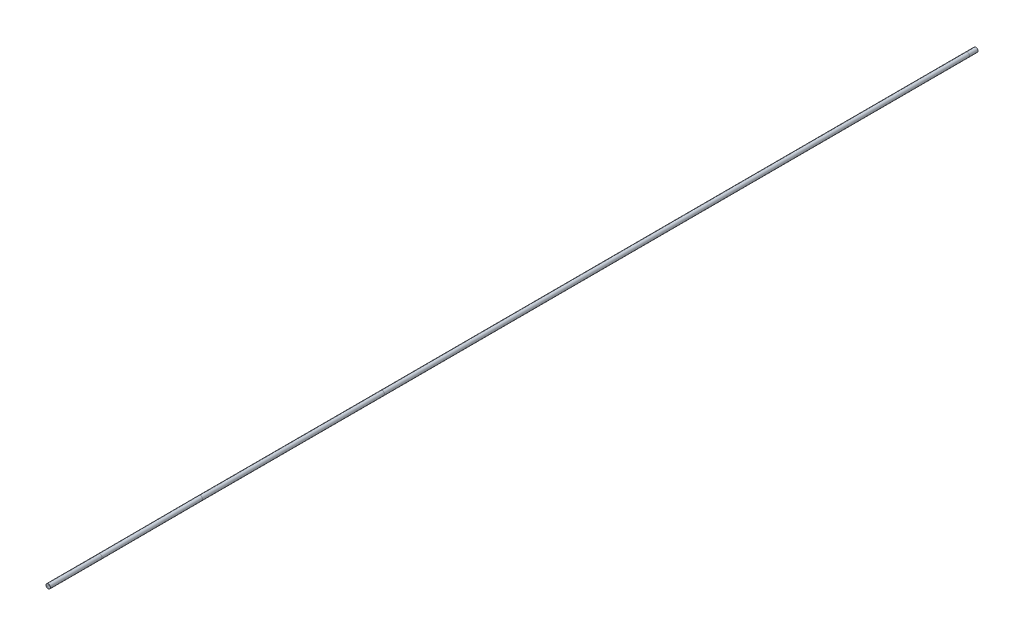
ISO-10303-21;
HEADER;
FILE_DESCRIPTION(('STEP AP214'),'2;1');
FILE_NAME('part.step','',(''),(''),'','','');
FILE_SCHEMA(('AUTOMOTIVE_DESIGN { 1 0 10303 214 1 1 1 1 }'));
ENDSEC;
DATA;
#1=APPLICATION_CONTEXT('core data for automotive mechanical design processes');
#2=APPLICATION_PROTOCOL_DEFINITION('international standard','automotive_design',2000,#1);
#3=PRODUCT_CONTEXT('',#1,'mechanical');
#4=PRODUCT('Part','Part','',(#3));
#5=PRODUCT_RELATED_PRODUCT_CATEGORY('part','',(#4));
#6=PRODUCT_DEFINITION_FORMATION('','',#4);
#7=PRODUCT_DEFINITION_CONTEXT('part definition',#1,'design');
#8=PRODUCT_DEFINITION('design','',#6,#7);
#9=PRODUCT_DEFINITION_SHAPE('','',#8);
#10=(LENGTH_UNIT() NAMED_UNIT(*) SI_UNIT(.MILLI.,.METRE.));
#11=(NAMED_UNIT(*) PLANE_ANGLE_UNIT() SI_UNIT($,.RADIAN.));
#12=(NAMED_UNIT(*) SI_UNIT($,.STERADIAN.) SOLID_ANGLE_UNIT());
#13=UNCERTAINTY_MEASURE_WITH_UNIT(LENGTH_MEASURE(1.E-05),#10,'distance_accuracy_value','');
#14=(GEOMETRIC_REPRESENTATION_CONTEXT(3) GLOBAL_UNCERTAINTY_ASSIGNED_CONTEXT((#13)) GLOBAL_UNIT_ASSIGNED_CONTEXT((#10,
#11,#12)) REPRESENTATION_CONTEXT('',''));
#15=CARTESIAN_POINT('',(0.,0.,0.));
#16=DIRECTION('',(0.,0.,1.));
#17=DIRECTION('',(1.,0.,0.));
#18=AXIS2_PLACEMENT_3D('',#15,#16,#17);
#19=CARTESIAN_POINT('',(-7.09899745318755,-7.80704253876515,-909.795823025885));
#20=DIRECTION('',(0.,0.,1.));
#21=DIRECTION('',(1.,0.,0.));
#22=AXIS2_PLACEMENT_3D('',#19,#20,#21);
#23=PLANE('',#22);
#24=CARTESIAN_POINT('',(-7.09899745318755,-7.80704253876515,-909.795823025885));
#25=DIRECTION('',(0.,0.,1.));
#26=DIRECTION('',(1.,0.,0.));
#27=AXIS2_PLACEMENT_3D('',#24,#25,#26);
#28=CIRCLE('',#27,2.1);
#29=CARTESIAN_POINT('',(-4.99899745318755,-7.80704253876515,-909.795823025885));
#30=VERTEX_POINT('',#29);
#31=EDGE_CURVE('E42',#30,#30,#28,.T.);
#32=ORIENTED_EDGE('',*,*,#31,.F.);
#33=EDGE_LOOP('',(#32));
#34=FACE_BOUND('',#33,.T.);
#35=ADVANCED_FACE('F39',(#34),#23,.F.);
#36=CARTESIAN_POINT('',(-17.2805682817183,-19.0041104478658,93.6165047554616));
#37=DIRECTION('',(0.,0.,1.));
#38=DIRECTION('',(1.,0.,0.));
#39=AXIS2_PLACEMENT_3D('',#36,#37,#38);
#40=PLANE('',#39);
#41=CARTESIAN_POINT('',(-17.2805682817183,-19.0041104478658,93.6165047554616));
#42=DIRECTION('',(0.,0.,1.));
#43=DIRECTION('',(1.,0.,0.));
#44=AXIS2_PLACEMENT_3D('',#41,#42,#43);
#45=CIRCLE('',#44,2.1);
#46=CARTESIAN_POINT('',(-15.1805682817183,-19.0041104478658,93.6165047554616));
#47=VERTEX_POINT('',#46);
#48=EDGE_CURVE('E46',#47,#47,#45,.T.);
#49=ORIENTED_EDGE('',*,*,#48,.T.);
#50=EDGE_LOOP('',(#49));
#51=FACE_BOUND('',#50,.T.);
#52=ADVANCED_FACE('F68',(#51),#40,.T.);
#53=CARTESIAN_POINT('',(-7.09899745318753,-7.80704253876517,-900.266459371352));
#54=DIRECTION('',(0.,0.,-1.));
#55=DIRECTION('',(-1.,0.,0.));
#56=AXIS2_PLACEMENT_3D('',#53,#54,#55);
#57=CYLINDRICAL_SURFACE('',#56,2.1);
#58=CARTESIAN_POINT('',(-7.09899745318754,-7.80704253876517,-900.466459371352));
#59=DIRECTION('',(0.00504607885021758,0.00554936841398394,-0.999971870403585));
#60=DIRECTION('',(0.67274134868714,0.739839725457515,0.00750056008286953));
#61=AXIS2_PLACEMENT_3D('',#58,#59,#60);
#62=ELLIPSE('',#61,2.1000590738142,2.1);
#63=CARTESIAN_POINT('',(-5.68620087954711,-6.25333541014991,-900.450707752092));
#64=VERTEX_POINT('',#63);
#65=EDGE_CURVE('E58',#64,#64,#62,.T.);
#66=ORIENTED_EDGE('',*,*,#65,.T.);
#67=EDGE_LOOP('',(#66));
#68=FACE_BOUND('',#67,.T.);
#69=ORIENTED_EDGE('',*,*,#31,.T.);
#70=EDGE_LOOP('',(#69));
#71=FACE_BOUND('',#70,.T.);
#72=ADVANCED_FACE('F65',(#68,#71),#57,.T.);
#73=CARTESIAN_POINT('',(-13.487074464187,-14.8322583237687,-267.545520811008));
#74=DIRECTION('',(0.0100918738121146,0.0110984246249779,-0.999887483196886));
#75=DIRECTION('',(0.,0.999938404315332,0.0110989898327681));
#76=AXIS2_PLACEMENT_3D('',#73,#74,#75);
#77=CYLINDRICAL_SURFACE('',#76,2.1);
#78=CARTESIAN_POINT('',(-13.4850560894246,-14.8300386388437,-267.745498307647));
#79=DIRECTION('',(0.00504607885021754,0.00554936841398395,-0.999971870403585));
#80=DIRECTION('',(-0.672741348687144,-0.739839725457512,-0.00750056008286951));
#81=AXIS2_PLACEMENT_3D('',#78,#79,#80);
#82=ELLIPSE('',#81,2.1000590738142,2.1);
#83=CARTESIAN_POINT('',(-14.897852663065,-16.383745767459,-267.761249926908));
#84=VERTEX_POINT('',#83);
#85=EDGE_CURVE('E56',#84,#84,#82,.T.);
#86=ORIENTED_EDGE('',*,*,#85,.T.);
#87=EDGE_LOOP('',(#86));
#88=FACE_BOUND('',#87,.T.);
#89=ORIENTED_EDGE('',*,*,#65,.F.);
#90=EDGE_LOOP('',(#89));
#91=FACE_BOUND('',#90,.T.);
#92=ADVANCED_FACE('F88',(#88,#91),#77,.T.);
#93=CARTESIAN_POINT('',(-13.4850560894241,-14.8300386388442,-68.7186343243757));
#94=DIRECTION('',(0.,0.,-1.));
#95=DIRECTION('',(-1.,0.,0.));
#96=AXIS2_PLACEMENT_3D('',#93,#94,#95);
#97=CYLINDRICAL_SURFACE('',#96,2.1);
#98=CARTESIAN_POINT('',(-13.485056089424,-14.8300386388442,-68.9510200389236));
#99=DIRECTION('',(0.0179059021207442,0.019691814298224,-0.999645742810365));
#100=DIRECTION('',(0.672521942998442,0.739598436521122,0.0266155759117366));
#101=AXIS2_PLACEMENT_3D('',#98,#99,#100);
#102=ELLIPSE('',#101,2.10074420373776,2.1);
#103=CARTESIAN_POINT('',(-12.0722595157836,-13.2763315102289,-68.8951075220978));
#104=VERTEX_POINT('',#103);
#105=EDGE_CURVE('E51',#104,#104,#102,.T.);
#106=ORIENTED_EDGE('',*,*,#105,.T.);
#107=EDGE_LOOP('',(#106));
#108=FACE_BOUND('',#107,.T.);
#109=ORIENTED_EDGE('',*,*,#85,.F.);
#110=EDGE_LOOP('',(#109));
#111=FACE_BOUND('',#110,.T.);
#112=ADVANCED_FACE('F81',(#108,#111),#97,.T.);
#113=CARTESIAN_POINT('',(-17.2888874852543,-19.0132593983085,37.1533328387921));
#114=DIRECTION('',(0.0357991176523646,0.0393696766628615,-0.998583222237773));
#115=DIRECTION('',(0.,0.999223718495005,0.0393949285697527));
#116=AXIS2_PLACEMENT_3D('',#113,#114,#115);
#117=CYLINDRICAL_SURFACE('',#116,2.1);
#118=CARTESIAN_POINT('',(-17.2805682817185,-19.0041104478657,36.9212763631568));
#119=DIRECTION('',(0.0179059021207442,0.019691814298224,-0.999645742810365));
#120=DIRECTION('',(-0.672521942998441,-0.739598436521122,-0.0266155759117366));
#121=AXIS2_PLACEMENT_3D('',#118,#119,#120);
#122=ELLIPSE('',#121,2.10074420373776,2.1);
#123=CARTESIAN_POINT('',(-18.6933648553589,-20.5578175764809,36.8653638463311));
#124=VERTEX_POINT('',#123);
#125=EDGE_CURVE('E11',#124,#124,#122,.T.);
#126=ORIENTED_EDGE('',*,*,#125,.T.);
#127=EDGE_LOOP('',(#126));
#128=FACE_BOUND('',#127,.T.);
#129=ORIENTED_EDGE('',*,*,#105,.F.);
#130=EDGE_LOOP('',(#129));
#131=FACE_BOUND('',#130,.T.);
#132=ADVANCED_FACE('F75',(#128,#131),#117,.T.);
#133=CARTESIAN_POINT('',(-17.2805682817183,-19.0041104478658,93.6165047554616));
#134=DIRECTION('',(0.,0.,-1.));
#135=DIRECTION('',(-1.,0.,0.));
#136=AXIS2_PLACEMENT_3D('',#133,#134,#135);
#137=CYLINDRICAL_SURFACE('',#136,2.1);
#138=ORIENTED_EDGE('',*,*,#48,.F.);
#139=EDGE_LOOP('',(#138));
#140=FACE_BOUND('',#139,.T.);
#141=ORIENTED_EDGE('',*,*,#125,.F.);
#142=EDGE_LOOP('',(#141));
#143=FACE_BOUND('',#142,.T.);
#144=ADVANCED_FACE('F73',(#140,#143),#137,.T.);
#145=CLOSED_SHELL('',(#35,#52,#72,#92,#112,#132,#144));
#146=MANIFOLD_SOLID_BREP('B2',#145);
#147=CARTESIAN_POINT('',(-7.09899745318755,-7.80704253876515,-909.795823025885));
#148=DIRECTION('',(0.,0.,1.));
#149=DIRECTION('',(1.,0.,0.));
#150=AXIS2_PLACEMENT_3D('',#147,#148,#149);
#151=PLANE('',#150);
#152=CARTESIAN_POINT('',(-7.09899745318755,-7.80704253876515,-909.795823025885));
#153=DIRECTION('',(0.,0.,1.));
#154=DIRECTION('',(1.,0.,0.));
#155=AXIS2_PLACEMENT_3D('',#152,#153,#154);
#156=CIRCLE('',#155,2.4);
#157=CARTESIAN_POINT('',(-4.69899745318756,-7.80704253876515,-909.795823025885));
#158=VERTEX_POINT('',#157);
#159=EDGE_CURVE('E143',#158,#158,#156,.T.);
#160=ORIENTED_EDGE('',*,*,#159,.F.);
#161=EDGE_LOOP('',(#160));
#162=FACE_BOUND('',#161,.T.);
#163=ADVANCED_FACE('F140',(#162),#151,.F.);
#164=CARTESIAN_POINT('',(-17.2805682817183,-19.0041104478658,93.6165047554616));
#165=DIRECTION('',(0.,0.,1.));
#166=DIRECTION('',(1.,0.,0.));
#167=AXIS2_PLACEMENT_3D('',#164,#165,#166);
#168=PLANE('',#167);
#169=CARTESIAN_POINT('',(-17.2805682817183,-19.0041104478658,93.6165047554616));
#170=DIRECTION('',(0.,0.,1.));
#171=DIRECTION('',(1.,0.,0.));
#172=AXIS2_PLACEMENT_3D('',#169,#170,#171);
#173=CIRCLE('',#172,2.4);
#174=CARTESIAN_POINT('',(-14.8805682817183,-19.0041104478658,93.6165047554616));
#175=VERTEX_POINT('',#174);
#176=EDGE_CURVE('E147',#175,#175,#173,.T.);
#177=ORIENTED_EDGE('',*,*,#176,.T.);
#178=EDGE_LOOP('',(#177));
#179=FACE_BOUND('',#178,.T.);
#180=ADVANCED_FACE('F169',(#179),#168,.T.);
#181=CARTESIAN_POINT('',(-7.09899745318753,-7.80704253876517,-900.266459371352));
#182=DIRECTION('',(0.,0.,-1.));
#183=DIRECTION('',(-1.,0.,0.));
#184=AXIS2_PLACEMENT_3D('',#181,#182,#183);
#185=CYLINDRICAL_SURFACE('',#184,2.4);
#186=CARTESIAN_POINT('',(-7.09899745318754,-7.80704253876517,-900.466459371352));
#187=DIRECTION('',(0.00504607885021758,0.00554936841398394,-0.999971870403585));
#188=DIRECTION('',(0.67274134868714,0.739839725457515,0.00750056008286953));
#189=AXIS2_PLACEMENT_3D('',#186,#187,#188);
#190=ELLIPSE('',#189,2.40006751293051,2.4);
#191=CARTESIAN_POINT('',(-5.48437279759848,-6.03137724891916,-900.448457520769));
#192=VERTEX_POINT('',#191);
#193=EDGE_CURVE('E159',#192,#192,#190,.T.);
#194=ORIENTED_EDGE('',*,*,#193,.T.);
#195=EDGE_LOOP('',(#194));
#196=FACE_BOUND('',#195,.T.);
#197=ORIENTED_EDGE('',*,*,#159,.T.);
#198=EDGE_LOOP('',(#197));
#199=FACE_BOUND('',#198,.T.);
#200=ADVANCED_FACE('F166',(#196,#199),#185,.T.);
#201=CARTESIAN_POINT('',(-13.487074464187,-14.8322583237687,-267.545520811008));
#202=DIRECTION('',(0.0100918738121146,0.0110984246249779,-0.999887483196886));
#203=DIRECTION('',(0.,0.999938404315332,0.0110989898327681));
#204=AXIS2_PLACEMENT_3D('',#201,#202,#203);
#205=CYLINDRICAL_SURFACE('',#204,2.4);
#206=CARTESIAN_POINT('',(-13.4850560894246,-14.8300386388437,-267.745498307647));
#207=DIRECTION('',(0.00504607885021754,0.00554936841398395,-0.999971870403585));
#208=DIRECTION('',(-0.672741348687144,-0.739839725457512,-0.00750056008286951));
#209=AXIS2_PLACEMENT_3D('',#206,#207,#208);
#210=ELLIPSE('',#209,2.40006751293051,2.4);
#211=CARTESIAN_POINT('',(-15.0996807450136,-16.6057039286897,-267.763500158231));
#212=VERTEX_POINT('',#211);
#213=EDGE_CURVE('E157',#212,#212,#210,.T.);
#214=ORIENTED_EDGE('',*,*,#213,.T.);
#215=EDGE_LOOP('',(#214));
#216=FACE_BOUND('',#215,.T.);
#217=ORIENTED_EDGE('',*,*,#193,.F.);
#218=EDGE_LOOP('',(#217));
#219=FACE_BOUND('',#218,.T.);
#220=ADVANCED_FACE('F189',(#216,#219),#205,.T.);
#221=CARTESIAN_POINT('',(-13.4850560894241,-14.8300386388442,-68.6997220794403));
#222=DIRECTION('',(0.,0.,-1.));
#223=DIRECTION('',(-1.,0.,0.));
#224=AXIS2_PLACEMENT_3D('',#221,#222,#223);
#225=CYLINDRICAL_SURFACE('',#224,2.4);
#226=CARTESIAN_POINT('',(-13.485056089424,-14.8300386388442,-68.9510200389236));
#227=DIRECTION('',(0.0179059021207442,0.019691814298224,-0.999645742810365));
#228=DIRECTION('',(0.672521942998442,0.739598436521122,0.0266155759117366));
#229=AXIS2_PLACEMENT_3D('',#226,#227,#228);
#230=ELLIPSE('',#229,2.40085051855744,2.4);
#231=CARTESIAN_POINT('',(-11.870431433835,-13.0543733489982,-68.8871200196942));
#232=VERTEX_POINT('',#231);
#233=EDGE_CURVE('E152',#232,#232,#230,.T.);
#234=ORIENTED_EDGE('',*,*,#233,.T.);
#235=EDGE_LOOP('',(#234));
#236=FACE_BOUND('',#235,.T.);
#237=ORIENTED_EDGE('',*,*,#213,.F.);
#238=EDGE_LOOP('',(#237));
#239=FACE_BOUND('',#238,.T.);
#240=ADVANCED_FACE('F182',(#236,#239),#225,.T.);
#241=CARTESIAN_POINT('',(-17.2895645269358,-19.0140039672766,37.1722182892794));
#242=DIRECTION('',(0.0357991176523646,0.0393696766628615,-0.998583222237773));
#243=DIRECTION('',(0.,0.999223718495005,0.0393949285697527));
#244=AXIS2_PLACEMENT_3D('',#241,#242,#243);
#245=CYLINDRICAL_SURFACE('',#244,2.4);
#246=CARTESIAN_POINT('',(-17.2805682817185,-19.0041104478657,36.9212763631568));
#247=DIRECTION('',(0.0179059021207442,0.019691814298224,-0.999645742810365));
#248=DIRECTION('',(-0.672521942998441,-0.739598436521122,-0.0266155759117366));
#249=AXIS2_PLACEMENT_3D('',#246,#247,#248);
#250=ELLIPSE('',#249,2.40085051855744,2.4);
#251=CARTESIAN_POINT('',(-18.8951929373075,-20.7797757377117,36.8573763439274));
#252=VERTEX_POINT('',#251);
#253=EDGE_CURVE('E38',#252,#252,#250,.T.);
#254=ORIENTED_EDGE('',*,*,#253,.T.);
#255=EDGE_LOOP('',(#254));
#256=FACE_BOUND('',#255,.T.);
#257=ORIENTED_EDGE('',*,*,#233,.F.);
#258=EDGE_LOOP('',(#257));
#259=FACE_BOUND('',#258,.T.);
#260=ADVANCED_FACE('F176',(#256,#259),#245,.T.);
#261=CARTESIAN_POINT('',(-17.2805682817183,-19.0041104478658,93.6165047554616));
#262=DIRECTION('',(0.,0.,-1.));
#263=DIRECTION('',(-1.,0.,0.));
#264=AXIS2_PLACEMENT_3D('',#261,#262,#263);
#265=CYLINDRICAL_SURFACE('',#264,2.4);
#266=ORIENTED_EDGE('',*,*,#176,.F.);
#267=EDGE_LOOP('',(#266));
#268=FACE_BOUND('',#267,.T.);
#269=ORIENTED_EDGE('',*,*,#253,.F.);
#270=EDGE_LOOP('',(#269));
#271=FACE_BOUND('',#270,.T.);
#272=ADVANCED_FACE('F174',(#268,#271),#265,.T.);
#273=CLOSED_SHELL('',(#163,#180,#200,#220,#240,#260,#272));
#274=MANIFOLD_SOLID_BREP('B6',#273);
#275=ADVANCED_BREP_SHAPE_REPRESENTATION('',(#18,#146,#274),#14);
#276=SHAPE_DEFINITION_REPRESENTATION(#9,#275);
ENDSEC;
END-ISO-10303-21;
